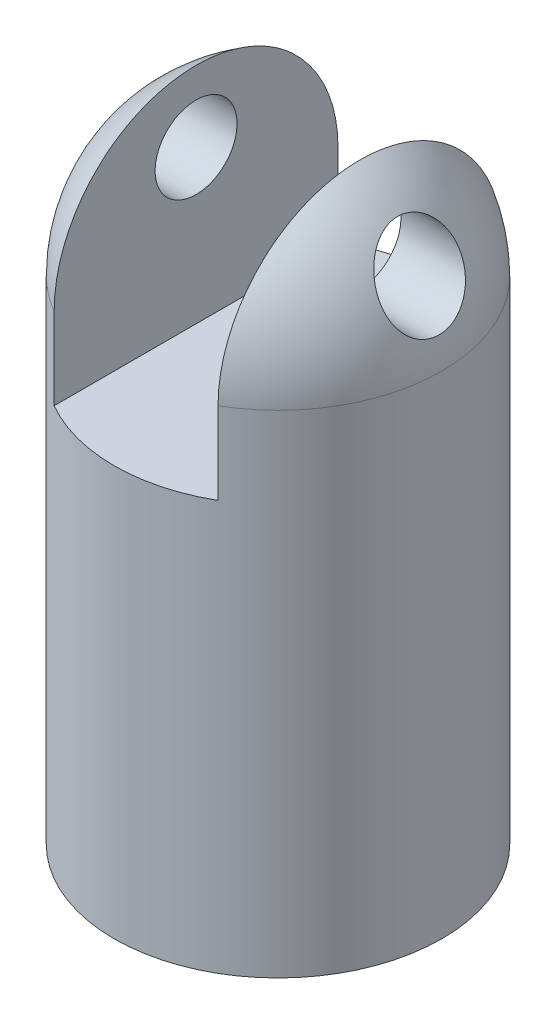
ISO-10303-21;
HEADER;
FILE_DESCRIPTION(('STEP AP214'),'2;1');
FILE_NAME('part.step','',(''),(''),'','','');
FILE_SCHEMA(('AUTOMOTIVE_DESIGN { 1 0 10303 214 1 1 1 1 }'));
ENDSEC;
DATA;
#1=APPLICATION_CONTEXT('core data for automotive mechanical design processes');
#2=APPLICATION_PROTOCOL_DEFINITION('international standard','automotive_design',2000,#1);
#3=PRODUCT_CONTEXT('',#1,'mechanical');
#4=PRODUCT('Part','Part','',(#3));
#5=PRODUCT_RELATED_PRODUCT_CATEGORY('part','',(#4));
#6=PRODUCT_DEFINITION_FORMATION('','',#4);
#7=PRODUCT_DEFINITION_CONTEXT('part definition',#1,'design');
#8=PRODUCT_DEFINITION('design','',#6,#7);
#9=PRODUCT_DEFINITION_SHAPE('','',#8);
#10=(LENGTH_UNIT() NAMED_UNIT(*) SI_UNIT(.MILLI.,.METRE.));
#11=(NAMED_UNIT(*) PLANE_ANGLE_UNIT() SI_UNIT($,.RADIAN.));
#12=(NAMED_UNIT(*) SI_UNIT($,.STERADIAN.) SOLID_ANGLE_UNIT());
#13=UNCERTAINTY_MEASURE_WITH_UNIT(LENGTH_MEASURE(1.E-05),#10,'distance_accuracy_value','');
#14=(GEOMETRIC_REPRESENTATION_CONTEXT(3) GLOBAL_UNCERTAINTY_ASSIGNED_CONTEXT((#13)) GLOBAL_UNIT_ASSIGNED_CONTEXT((#10,
#11,#12)) REPRESENTATION_CONTEXT('',''));
#15=CARTESIAN_POINT('',(0.,0.,0.));
#16=DIRECTION('',(0.,0.,1.));
#17=DIRECTION('',(1.,0.,0.));
#18=AXIS2_PLACEMENT_3D('',#15,#16,#17);
#19=CARTESIAN_POINT('',(0.,25.4,0.));
#20=DIRECTION('',(0.,-1.,0.));
#21=DIRECTION('',(1.,0.,0.));
#22=AXIS2_PLACEMENT_3D('',#19,#20,#21);
#23=SPHERICAL_SURFACE('',#22,25.4);
#24=CARTESIAN_POINT('',(24.1067659282736,31.9767327217544,-4.55744488247566));
#25=CARTESIAN_POINT('',(24.0444484163491,32.113320363722,-4.68996590607931));
#26=CARTESIAN_POINT('',(23.9794512611999,32.2552577564646,-4.81574696550168));
#27=CARTESIAN_POINT('',(23.8446059934324,32.5484309341725,-5.05320692182729));
#28=CARTESIAN_POINT('',(23.7747552980228,32.6996716648831,-5.16487821981101));
#29=CARTESIAN_POINT('',(23.6306199599598,33.0102944005367,-5.37377960125299));
#30=CARTESIAN_POINT('',(23.5563270822191,33.1696914418156,-5.47098161941725));
#31=CARTESIAN_POINT('',(23.4039229555365,33.4950510332104,-5.65038801800512));
#32=CARTESIAN_POINT('',(23.3258101389545,33.6610162733875,-5.73258617448005));
#33=CARTESIAN_POINT('',(23.1666752568291,33.9973570510674,-5.88137316864954));
#34=CARTESIAN_POINT('',(23.0856685104425,34.1677083247871,-5.94803322913717));
#35=CARTESIAN_POINT('',(22.9208956714156,34.5123306312923,-6.06613587048315));
#36=CARTESIAN_POINT('',(22.8371286071705,34.6866030372813,-6.11757302804721));
#37=CARTESIAN_POINT('',(22.5825557890585,35.2132197282875,-6.24885540931262));
#38=CARTESIAN_POINT('',(22.4082591017683,35.5698279594476,-6.30587461774937));
#39=CARTESIAN_POINT('',(22.0418942117782,36.3103676958626,-6.36101430271709));
#40=CARTESIAN_POINT('',(21.849446490856,36.6944294241809,-6.3546311154983));
#41=CARTESIAN_POINT('',(21.4631860729466,37.4549761078759,-6.27316051768274));
#42=CARTESIAN_POINT('',(21.2693727755179,37.8314574078448,-6.19804073542434));
#43=CARTESIAN_POINT('',(20.9776692437583,38.3904946137016,-6.03279535611646));
#44=CARTESIAN_POINT('',(20.8782044029929,38.5797392006624,-5.9669997748354));
#45=CARTESIAN_POINT('',(20.6811771080738,38.9519830545496,-5.81743206355566));
#46=CARTESIAN_POINT('',(20.5836139229022,39.1349847424543,-5.73366699607142));
#47=CARTESIAN_POINT('',(20.3911788847679,39.4934426715054,-5.54839762775656));
#48=CARTESIAN_POINT('',(20.2963088355268,39.6688938945172,-5.44688174965565));
#49=CARTESIAN_POINT('',(20.1103056355184,40.010564510069,-5.22656142828014));
#50=CARTESIAN_POINT('',(20.0191706359655,40.1767884847417,-5.10776567402362));
#51=CARTESIAN_POINT('',(19.8443211938262,40.4936329956252,-4.85717213462343));
#52=CARTESIAN_POINT('',(19.7604654443834,40.6445740987647,-4.72587880925253));
#53=CARTESIAN_POINT('',(19.598262484832,40.9347992223381,-4.44803604625286));
#54=CARTESIAN_POINT('',(19.5199124369688,41.0740892551315,-4.3014945659151));
#55=CARTESIAN_POINT('',(19.3698167544146,41.33945127325,-3.99386670936604));
#56=CARTESIAN_POINT('',(19.2980687089831,41.4655280857768,-3.83278568521531));
#57=CARTESIAN_POINT('',(19.1623390955179,41.7028426416225,-3.49698975300642));
#58=CARTESIAN_POINT('',(19.0983562498694,41.8140828263232,-3.32227709556493));
#59=CARTESIAN_POINT('',(18.9861531706613,42.0083110930847,-2.98107486577096));
#60=CARTESIAN_POINT('',(18.9369677778434,42.0930736062235,-2.81591158716087));
#61=CARTESIAN_POINT('',(18.8465064667782,42.2484556501779,-2.47699774258156));
#62=CARTESIAN_POINT('',(18.8052290769566,42.3190778124356,-2.30324878187852));
#63=CARTESIAN_POINT('',(18.7314104257847,42.4450450376803,-1.94869828909523));
#64=CARTESIAN_POINT('',(18.6988603744596,42.5004054735243,-1.76790406470532));
#65=CARTESIAN_POINT('',(18.6431369954342,42.5950013612391,-1.40073957041088));
#66=CARTESIAN_POINT('',(18.6199622147136,42.6342393118577,-1.21437016938364));
#67=CARTESIAN_POINT('',(18.5860482048552,42.691597640096,-0.864109321261313));
#68=CARTESIAN_POINT('',(18.5740281756377,42.7118952751756,-0.700694371574415));
#69=CARTESIAN_POINT('',(18.5575374687881,42.7397321379968,-0.372408807224453));
#70=CARTESIAN_POINT('',(18.5530660185726,42.7472726714048,-0.207538343267098));
#71=CARTESIAN_POINT('',(18.5517536983615,42.7494862796409,0.122261922017643));
#72=CARTESIAN_POINT('',(18.5549102947045,42.7441636269858,0.287191685454598));
#73=CARTESIAN_POINT('',(18.5687910579585,42.7207375024074,0.615818599191677));
#74=CARTESIAN_POINT('',(18.5795151071837,42.7026342292424,0.779515768620538));
#75=CARTESIAN_POINT('',(18.6073933269311,42.6555035701761,1.09373506656002));
#76=CARTESIAN_POINT('',(18.6240809769395,42.6272682590538,1.24441855532437));
#77=CARTESIAN_POINT('',(18.6636509661952,42.5601921686238,1.54262501781982));
#78=CARTESIAN_POINT('',(18.6865352716214,42.521348023133,1.690146972346));
#79=CARTESIAN_POINT('',(18.7381622665648,42.4335122518719,1.98102912935381));
#80=CARTESIAN_POINT('',(18.766903168393,42.3845237225369,2.12439058658194));
#81=CARTESIAN_POINT('',(18.8298762953943,42.2768916768668,2.40625187448572));
#82=CARTESIAN_POINT('',(18.864110614475,42.2182444787438,2.54474982672205));
#83=CARTESIAN_POINT('',(18.9392819419077,42.0890629012324,2.82217754682662));
#84=CARTESIAN_POINT('',(18.9804491751019,42.0181161385597,2.96085308967179));
#85=CARTESIAN_POINT('',(19.0678142264806,41.8670013211195,3.23145300978263));
#86=CARTESIAN_POINT('',(19.1140138568231,41.7868299439945,3.36337492977526));
#87=CARTESIAN_POINT('',(19.259398197427,41.53352779201,3.74811795215721));
#88=CARTESIAN_POINT('',(19.36541064445,41.3475367028026,3.99006972234366));
#89=CARTESIAN_POINT('',(19.6046478705394,40.9238424653064,4.46736717031787));
#90=CARTESIAN_POINT('',(19.739601683148,40.6826469641009,4.69871657879927));
#91=CARTESIAN_POINT('',(20.0222588163141,40.1717179345171,5.11808535579574));
#92=CARTESIAN_POINT('',(20.1699685208401,39.9019701010718,5.30608285311728));
#93=CARTESIAN_POINT('',(20.4932334202904,39.3046717841485,5.65789446865096));
#94=CARTESIAN_POINT('',(20.6699390802303,38.9741350198949,5.81557915711234));
#95=CARTESIAN_POINT('',(21.0290140158839,38.2934495378177,6.07156845306132));
#96=CARTESIAN_POINT('',(21.2113858300986,37.9432919715176,6.16984603010441));
#97=CARTESIAN_POINT('',(21.493333335013,37.3948629168557,6.27442986560052));
#98=CARTESIAN_POINT('',(21.592657419344,37.2003120816548,6.3022418752606));
#99=CARTESIAN_POINT('',(21.7909157660231,36.8092955224244,6.33973947957559));
#100=CARTESIAN_POINT('',(21.8898501402618,36.6128304143734,6.34943072336078));
#101=CARTESIAN_POINT('',(22.0867347992221,36.2192190219207,6.35052103788459));
#102=CARTESIAN_POINT('',(22.1846844572437,36.0220723992863,6.34190911937569));
#103=CARTESIAN_POINT('',(22.3788618015764,35.6286903773078,6.30625424483267));
#104=CARTESIAN_POINT('',(22.4750901745942,35.432454638798,6.27921881511904));
#105=CARTESIAN_POINT('',(22.666343975149,35.0399812292169,6.2062205702503));
#106=CARTESIAN_POINT('',(22.7613418671887,34.8437707818054,6.16003848238049));
#107=CARTESIAN_POINT('',(22.9482482983262,34.4553812049825,6.04875927522458));
#108=CARTESIAN_POINT('',(23.0401581673119,34.2632003539457,5.98367041790487));
#109=CARTESIAN_POINT('',(23.220280696089,33.8843976381466,5.83464757351826));
#110=CARTESIAN_POINT('',(23.3084921913687,33.6977775295746,5.75070770291203));
#111=CARTESIAN_POINT('',(23.4804498006942,33.3320137664689,5.56427271146433));
#112=CARTESIAN_POINT('',(23.5641982438117,33.1528662231498,5.46178739389397));
#113=CARTESIAN_POINT('',(23.7218507545008,32.8139342328101,5.24512160364916));
#114=CARTESIAN_POINT('',(23.7960440732733,32.6536294607785,5.13196556877372));
#115=CARTESIAN_POINT('',(23.9392472606288,32.3428672505327,4.89008224670179));
#116=CARTESIAN_POINT('',(24.0082597191461,32.1924048969562,4.76136282486635));
#117=CARTESIAN_POINT('',(24.1405177767839,31.9029086062082,4.4890352477524));
#118=CARTESIAN_POINT('',(24.2037648272001,31.7638717938185,4.3454308589476));
#119=CARTESIAN_POINT('',(24.3239066348453,31.498827084434,4.04421985781086));
#120=CARTESIAN_POINT('',(24.3808020615327,31.3728178144457,3.88661472430157));
#121=CARTESIAN_POINT('',(24.4825531701229,31.1467685039183,3.57423039759022));
#122=CARTESIAN_POINT('',(24.528039724328,31.0453976750076,3.4206181953348));
#123=CARTESIAN_POINT('',(24.6129279602025,30.8557590793566,3.10392115692758));
#124=CARTESIAN_POINT('',(24.6523303107103,30.7674898723921,2.94083736470696));
#125=CARTESIAN_POINT('',(24.7246570549309,30.6051373435997,2.60647481786112));
#126=CARTESIAN_POINT('',(24.7575845271505,30.5310472806917,2.43520000608039));
#127=CARTESIAN_POINT('',(24.8166488802023,30.3979354279071,2.08576132634077));
#128=CARTESIAN_POINT('',(24.8427862657652,30.3389125180426,1.90759797156283));
#129=CARTESIAN_POINT('',(24.8859955321855,30.2412252231228,1.56190415344241));
#130=CARTESIAN_POINT('',(24.9036643368117,30.2012228618724,1.39482500351083));
#131=CARTESIAN_POINT('',(24.9329678347654,30.1348327520086,1.05746721739549));
#132=CARTESIAN_POINT('',(24.9446029622739,30.1084440237645,0.887188812342826));
#133=CARTESIAN_POINT('',(24.9617277752377,30.0695916968093,0.544802229501386));
#134=CARTESIAN_POINT('',(24.9672195093803,30.0571234559231,0.372694681031411));
#135=CARTESIAN_POINT('',(24.9720121429463,30.0462429101723,0.0279500954681088));
#136=CARTESIAN_POINT('',(24.9713131725779,30.047830309678,-0.144686930412462));
#137=CARTESIAN_POINT('',(24.9639127542128,30.0646297726794,-0.480905671172986));
#138=CARTESIAN_POINT('',(24.9574989667483,30.0791888908572,-0.644526827779586));
#139=CARTESIAN_POINT('',(24.9391163415111,30.1208868004365,-0.969894983434491));
#140=CARTESIAN_POINT('',(24.9271457774274,30.1480295011472,-1.13164138403957));
#141=CARTESIAN_POINT('',(24.8977496917048,30.2146137242776,-1.4520857956883));
#142=CARTESIAN_POINT('',(24.8803238026496,30.2540560750788,-1.61078360064455));
#143=CARTESIAN_POINT('',(24.8401613361378,30.3448362887165,-1.92405246563178));
#144=CARTESIAN_POINT('',(24.8174245840659,30.3961745426767,-2.07862338978922));
#145=CARTESIAN_POINT('',(24.7666683845508,30.510585690838,-2.38356475890651));
#146=CARTESIAN_POINT('',(24.7386174876163,30.5737284138051,-2.53390374288728));
#147=CARTESIAN_POINT('',(24.6775528268641,30.7109095474267,-2.82841648982709));
#148=CARTESIAN_POINT('',(24.6445405240725,30.7849447503483,-2.97259205177888));
#149=CARTESIAN_POINT('',(24.5738272622961,30.9431655219281,-3.25385784727628));
#150=CARTESIAN_POINT('',(24.5361308889764,31.0273411607611,-3.39095482739646));
#151=CARTESIAN_POINT('',(24.4563008329916,31.2051405229397,-3.65744900085771));
#152=CARTESIAN_POINT('',(24.4141684970727,31.2987613783847,-3.78684851256489));
#153=CARTESIAN_POINT('',(24.3294353969177,31.4865094883919,-4.02689259779938));
#154=CARTESIAN_POINT('',(24.2871679571178,31.5799407352148,-4.13820082999341));
#155=CARTESIAN_POINT('',(24.1993647484731,31.77347586833,-4.35343492938125));
#156=CARTESIAN_POINT('',(24.1538295205679,31.8735786500422,-4.45736201278647));
#157=CARTESIAN_POINT('',(24.1067659282736,31.9767327217544,-4.55744488247566));
#158=B_SPLINE_CURVE_WITH_KNOTS('',3,(#24,#25,#26,#27,#28,#29,#30,#31,#32,#33,#34,#35,#36,#37,
#38,#39,#40,#41,#42,#43,#44,#45,#46,#47,#48,#49,#50,#51,#52,#53,#54,#55,#56,#57,#58,#59,#60,#61,
#62,#63,#64,#65,#66,#67,#68,#69,#70,#71,#72,#73,#74,#75,#76,#77,#78,#79,#80,#81,#82,#83,#84,#85,
#86,#87,#88,#89,#90,#91,#92,#93,#94,#95,#96,#97,#98,#99,#100,#101,#102,#103,#104,#105,#106,#107,
#108,#109,#110,#111,#112,#113,#114,#115,#116,#117,#118,#119,#120,#121,#122,#123,#124,#125,#126,
#127,#128,#129,#130,#131,#132,#133,#134,#135,#136,#137,#138,#139,#140,#141,#142,#143,#144,#145,
#146,#147,#148,#149,#150,#151,#152,#153,#154,#155,#156,#157),.UNSPECIFIED.,.T.,.F.,(4,2,2,2,2,2,
2,2,2,2,2,2,2,2,2,2,2,2,2,2,2,2,2,2,2,2,2,2,2,2,2,2,2,2,2,2,2,2,2,2,2,2,2,2,2,2,2,2,2,2,2,2,2,2,
2,2,2,2,2,2,2,2,2,2,2,2,4),(0.,0.600609055431747,1.20154020707553,1.80362217600176,
2.40595333764768,3.00546674548304,3.60519347889519,4.80300834444186,6.08648319252329,
7.37056280739217,8.04094750271181,8.71106919910657,9.38162959751539,10.0518539693433,
10.7017230174655,11.3512546145263,12.0005480841184,12.6497345796639,13.2250544577627,
13.8002671722537,14.3748983507144,14.9494404361756,15.4441194127268,15.9387477567118,
16.4332118321053,16.9276682179845,17.3897794482795,17.8520374771656,18.314154615513,
18.7764483177551,19.259282203551,19.7422905354347,20.7077883297556,21.7848871163496,
22.8625281200307,24.0774176030192,25.292859449721,25.9528260630358,26.6125868981067,
27.2727439665241,27.932631510993,28.6002946874182,29.2676665431305,29.935246980678,
30.6024755552922,31.2309664558278,31.8591410494711,32.4871570768408,33.1151068489794,
33.6830996200317,34.251029906936,34.8186895127351,35.3863069103475,35.9037743399675,
36.4212045276724,36.9384621122458,37.4557088174535,37.9483039917629,38.4410523019996,
38.9338338060074,39.4266315144097,39.9224422878582,40.4181073408757,40.9132909097269,
41.408324573349,41.8619930217139,42.3155865436649),.UNSPECIFIED.);
#159=CARTESIAN_POINT('',(24.1067659282736,31.9767327217544,-4.55744488247566));
#160=VERTEX_POINT('',#159);
#161=EDGE_CURVE('E88',#160,#160,#158,.T.);
#162=ORIENTED_EDGE('',*,*,#161,.F.);
#163=EDGE_LOOP('',(#162));
#164=FACE_BOUND('',#163,.T.);
#165=CARTESIAN_POINT('',(12.7,25.4,0.));
#166=DIRECTION('',(1.,0.,0.));
#167=DIRECTION('',(0.,1.,0.));
#168=AXIS2_PLACEMENT_3D('',#165,#166,#167);
#169=CIRCLE('',#168,21.9970452561247);
#170=CARTESIAN_POINT('',(12.7,25.4,21.9970452561247));
#171=VERTEX_POINT('',#170);
#172=CARTESIAN_POINT('',(12.7,25.4,-21.9970452561247));
#173=VERTEX_POINT('',#172);
#174=EDGE_CURVE('E105',#171,#173,#169,.F.);
#175=ORIENTED_EDGE('',*,*,#174,.F.);
#176=CARTESIAN_POINT('',(0.,25.4,0.));
#177=DIRECTION('',(0.,-1.,0.));
#178=DIRECTION('',(0.,0.,-1.));
#179=AXIS2_PLACEMENT_3D('',#176,#177,#178);
#180=CIRCLE('',#179,25.4);
#181=EDGE_CURVE('E99',#173,#171,#180,.T.);
#182=ORIENTED_EDGE('',*,*,#181,.F.);
#183=EDGE_LOOP('',(#175,#182));
#184=FACE_BOUND('',#183,.T.);
#185=ADVANCED_FACE('F32',(#164,#184),#23,.T.);
#186=CARTESIAN_POINT('',(25.4,-50.8,0.));
#187=DIRECTION('',(0.,-1.,0.));
#188=DIRECTION('',(0.,0.,-1.));
#189=AXIS2_PLACEMENT_3D('',#186,#187,#188);
#190=PLANE('',#189);
#191=CARTESIAN_POINT('',(0.,-50.8,0.));
#192=DIRECTION('',(0.,-1.,0.));
#193=DIRECTION('',(0.,0.,-1.));
#194=AXIS2_PLACEMENT_3D('',#191,#192,#193);
#195=CIRCLE('',#194,6.35);
#196=CARTESIAN_POINT('',(0.,-50.8,-6.35));
#197=VERTEX_POINT('',#196);
#198=EDGE_CURVE('E162',#197,#197,#195,.T.);
#199=ORIENTED_EDGE('',*,*,#198,.F.);
#200=EDGE_LOOP('',(#199));
#201=FACE_BOUND('',#200,.T.);
#202=CARTESIAN_POINT('',(0.,-50.8,0.));
#203=DIRECTION('',(0.,-1.,0.));
#204=DIRECTION('',(0.,0.,-1.));
#205=AXIS2_PLACEMENT_3D('',#202,#203,#204);
#206=CIRCLE('',#205,25.4);
#207=CARTESIAN_POINT('',(0.,-50.8,-25.4));
#208=VERTEX_POINT('',#207);
#209=EDGE_CURVE('E102',#208,#208,#206,.T.);
#210=ORIENTED_EDGE('',*,*,#209,.T.);
#211=EDGE_LOOP('',(#210));
#212=FACE_BOUND('',#211,.T.);
#213=ADVANCED_FACE('F34',(#201,#212),#190,.T.);
#214=CARTESIAN_POINT('',(-24.1067659282737,31.9767327217544,-4.55744488247567));
#215=CARTESIAN_POINT('',(-24.1615603172108,31.8566349990557,-4.44092715153506));
#216=CARTESIAN_POINT('',(-24.2142715131661,31.7406957878061,-4.31921536996981));
#217=CARTESIAN_POINT('',(-24.3151994023185,31.5180332430236,-4.06592169547366));
#218=CARTESIAN_POINT('',(-24.36341740763,31.4113072197038,-3.93434270437792));
#219=CARTESIAN_POINT('',(-24.4550511983215,31.2079420682348,-3.66187143542214));
#220=CARTESIAN_POINT('',(-24.4984634160644,31.1113104367443,-3.52097236100299));
#221=CARTESIAN_POINT('',(-24.5800953970052,30.9291779806055,-3.23080407064966));
#222=CARTESIAN_POINT('',(-24.6183173177503,30.8436725315511,-3.08153836930633));
#223=CARTESIAN_POINT('',(-24.6893917457881,30.6843552882006,-2.77501747246245));
#224=CARTESIAN_POINT('',(-24.7222264243764,30.6105823455966,-2.61773791972531));
#225=CARTESIAN_POINT('',(-24.7820782938099,30.4758858846986,-2.2967697593963));
#226=CARTESIAN_POINT('',(-24.8090977539316,30.4149573543124,-2.13308368140475));
#227=CARTESIAN_POINT('',(-24.8570885207483,30.3066011060729,-1.80044128304886));
#228=CARTESIAN_POINT('',(-24.878060015517,30.2591729683982,-1.63148512674933));
#229=CARTESIAN_POINT('',(-24.9137566155171,30.1783713391986,-1.28959965525727));
#230=CARTESIAN_POINT('',(-24.9284820061802,30.1449972054403,-1.11667052200092));
#231=CARTESIAN_POINT('',(-24.9509933812063,30.0939508575587,-0.776545073006986));
#232=CARTESIAN_POINT('',(-24.9590771061153,30.0756050652805,-0.609469224010855));
#233=CARTESIAN_POINT('',(-24.9693793843397,30.0522211885107,-0.274210509299681));
#234=CARTESIAN_POINT('',(-24.9715981149781,30.047182701684,-0.106027677207471));
#235=CARTESIAN_POINT('',(-24.9701505755965,30.0504691639374,0.230154683168544));
#236=CARTESIAN_POINT('',(-24.9664852218271,30.0587920324303,0.398154235915799));
#237=CARTESIAN_POINT('',(-24.953304463044,30.0887042570049,0.732735210201848));
#238=CARTESIAN_POINT('',(-24.9437891088714,30.1102934977914,0.899316644052469));
#239=CARTESIAN_POINT('',(-24.9193258892848,30.1657465332992,1.225406420504));
#240=CARTESIAN_POINT('',(-24.9045300534054,30.1992667589546,1.38498479945651));
#241=CARTESIAN_POINT('',(-24.8695957855658,30.2783147528563,1.70059667821662));
#242=CARTESIAN_POINT('',(-24.8494555799468,30.3238465073909,1.85662898247527));
#243=CARTESIAN_POINT('',(-24.8040057676937,30.4264393401338,2.16401620875617));
#244=CARTESIAN_POINT('',(-24.7786979455378,30.4834964383447,2.31537272470239));
#245=CARTESIAN_POINT('',(-24.7230958487316,30.6086224776484,2.61257810468568));
#246=CARTESIAN_POINT('',(-24.6927996969228,30.6766955640024,2.75842486984904));
#247=CARTESIAN_POINT('',(-24.6266639718543,30.8249804689179,3.04714565238958));
#248=CARTESIAN_POINT('',(-24.5907081962957,30.9054457319161,3.18986282153546));
#249=CARTESIAN_POINT('',(-24.5140648823414,31.0765392840549,3.46779983190332));
#250=CARTESIAN_POINT('',(-24.4733756318834,31.1671712499893,3.60301693413001));
#251=CARTESIAN_POINT('',(-24.3875700458774,31.3577668406224,3.86516988613331));
#252=CARTESIAN_POINT('',(-24.3424545505444,31.4577286940942,3.99210730002024));
#253=CARTESIAN_POINT('',(-24.2480736028722,31.6662122593763,4.23717293325775));
#254=CARTESIAN_POINT('',(-24.1988065884961,31.774737192117,4.35529780502911));
#255=CARTESIAN_POINT('',(-24.0930854398396,32.0068512103796,4.5896250891947));
#256=CARTESIAN_POINT('',(-24.0363719392852,32.1309613730268,4.7051953225631));
#257=CARTESIAN_POINT('',(-23.9189651944343,32.3869183097408,4.9252469017686));
#258=CARTESIAN_POINT('',(-23.8582704864151,32.5187679273862,5.02972413178521));
#259=CARTESIAN_POINT('',(-23.670785876963,32.924395482599,5.32586649581176));
#260=CARTESIAN_POINT('',(-23.5385277169801,33.2084013776446,5.50039159488251));
#261=CARTESIAN_POINT('',(-23.2503809154725,33.8214642232553,5.81466536314119));
#262=CARTESIAN_POINT('',(-23.0934368559411,34.1522838020697,5.94996958296969));
#263=CARTESIAN_POINT('',(-22.7696200259886,34.827430885867,6.162750481188));
#264=CARTESIAN_POINT('',(-22.6027433733441,35.1717636544229,6.24020438598697));
#265=CARTESIAN_POINT('',(-22.2479816501414,35.89533736496,6.34145748107917));
#266=CARTESIAN_POINT('',(-22.0595265870522,36.2750258060695,6.36004779797922));
#267=CARTESIAN_POINT('',(-21.6795922212548,37.0304851454668,6.32976948138732));
#268=CARTESIAN_POINT('',(-21.4881118538413,37.4062545836475,6.28087655086021));
#269=CARTESIAN_POINT('',(-21.1974404196384,37.9691275064737,6.15592150616813));
#270=CARTESIAN_POINT('',(-21.097441056827,38.1613903946098,6.10365317494819));
#271=CARTESIAN_POINT('',(-20.8987430716516,38.5407365820196,5.98106183155738));
#272=CARTESIAN_POINT('',(-20.8000439920969,38.7278217287585,5.91074535359119));
#273=CARTESIAN_POINT('',(-20.6046755243435,39.095562274711,5.75226964433556));
#274=CARTESIAN_POINT('',(-20.5080075950865,39.2762131129321,5.6640980411218));
#275=CARTESIAN_POINT('',(-20.3176818120112,39.6294499441862,5.47029860065325));
#276=CARTESIAN_POINT('',(-20.2240225751325,39.802039659878,5.364678925303));
#277=CARTESIAN_POINT('',(-20.0419723896207,40.1352748373215,5.13801425499881));
#278=CARTESIAN_POINT('',(-19.9535242340947,40.2960585898308,5.01721884945359));
#279=CARTESIAN_POINT('',(-19.7814726555333,40.6068485680474,4.75953944988538));
#280=CARTESIAN_POINT('',(-19.6978668918315,40.7568600093188,4.62266332734692));
#281=CARTESIAN_POINT('',(-19.5365589572685,41.0445725112122,4.33339663238924));
#282=CARTESIAN_POINT('',(-19.4588558146999,41.1822755987348,4.18100862329115));
#283=CARTESIAN_POINT('',(-19.3105245942678,41.4437066276086,3.86150330022097));
#284=CARTESIAN_POINT('',(-19.2398954961992,41.5674365844669,3.69438811672719));
#285=CARTESIAN_POINT('',(-19.1136294427977,41.7875532232373,3.36395766996697));
#286=CARTESIAN_POINT('',(-19.0571993004111,41.8854377324358,3.20194283760412));
#287=CARTESIAN_POINT('',(-18.9520092941505,42.0671981113691,2.86788406647819));
#288=CARTESIAN_POINT('',(-18.903247988885,42.1510766137776,2.6958420207254));
#289=CARTESIAN_POINT('',(-18.814347426968,42.3035115093611,2.34317517957212));
#290=CARTESIAN_POINT('',(-18.7741991046578,42.3720840160823,2.16255965531667));
#291=CARTESIAN_POINT('',(-18.7033056990095,42.4928691686845,1.79415593120481));
#292=CARTESIAN_POINT('',(-18.6725589756152,42.5450846679927,1.60636898879877));
#293=CARTESIAN_POINT('',(-18.6248181331507,42.6260242021947,1.25253183152654));
#294=CARTESIAN_POINT('',(-18.6064914517503,42.6570305813853,1.08717945870013));
#295=CARTESIAN_POINT('',(-18.5776044570324,42.7058617016849,0.753876895159823));
#296=CARTESIAN_POINT('',(-18.5670431621065,42.7236881088518,0.585927035530924));
#297=CARTESIAN_POINT('',(-18.5538876629006,42.7458885757763,0.248906598657259));
#298=CARTESIAN_POINT('',(-18.5512898843257,42.750268670694,0.079836558345812));
#299=CARTESIAN_POINT('',(-18.5541013726952,42.7455261940066,-0.258045365742084));
#300=CARTESIAN_POINT('',(-18.5595103343294,42.7364041372609,-0.426857259116396));
#301=CARTESIAN_POINT('',(-18.5774344840711,42.7061424613483,-0.748514653943864));
#302=CARTESIAN_POINT('',(-18.5893079165007,42.6860879539272,-0.901499775059955));
#303=CARTESIAN_POINT('',(-18.6194898263638,42.6350341525368,-1.20503744230425));
#304=CARTESIAN_POINT('',(-18.6378003211078,42.6040314274925,-1.35558921035533));
#305=CARTESIAN_POINT('',(-18.6805738927541,42.5314651914106,-1.65316767085902));
#306=CARTESIAN_POINT('',(-18.7050347503418,42.4899054897272,-1.80019561394217));
#307=CARTESIAN_POINT('',(-18.7597761946808,42.3966712162958,-2.08994954126388));
#308=CARTESIAN_POINT('',(-18.7900590041143,42.3449927813177,-2.23267385832889));
#309=CARTESIAN_POINT('',(-18.8568882394324,42.2306199556022,-2.51657478346615));
#310=CARTESIAN_POINT('',(-18.8935749914693,42.1676777374403,-2.65761856531444));
#311=CARTESIAN_POINT('',(-18.9721857960725,42.0323571962651,-2.93360906678705));
#312=CARTESIAN_POINT('',(-19.0141117182969,41.9599755042632,-3.06855358629258));
#313=CARTESIAN_POINT('',(-19.1470228134753,41.7296633737627,-3.46324980386748));
#314=CARTESIAN_POINT('',(-19.245182105283,41.5584964597747,-3.71303430790493));
#315=CARTESIAN_POINT('',(-19.467958238693,41.1665386822022,-4.20694447612861));
#316=CARTESIAN_POINT('',(-19.5942811131148,40.9424003637349,-4.44761672857736));
#317=CARTESIAN_POINT('',(-19.8607602042861,40.4644311214761,-4.88841996450517));
#318=CARTESIAN_POINT('',(-20.0009233031319,40.2105854138538,-5.08853062609014));
#319=CARTESIAN_POINT('',(-20.3096745282074,39.6450452984716,-5.46931480158647));
#320=CARTESIAN_POINT('',(-20.4795918517823,39.3301178197129,-5.64410380541294));
#321=CARTESIAN_POINT('',(-20.8266016969798,38.6784995322855,-5.93732599649962));
#322=CARTESIAN_POINT('',(-21.0036973222915,38.3417992714199,-6.05573451825244));
#323=CARTESIAN_POINT('',(-21.27973670744,37.8101866969173,-6.19416063808391));
#324=CARTESIAN_POINT('',(-21.3778659089828,37.619891817615,-6.2344640215001));
#325=CARTESIAN_POINT('',(-21.574222285387,37.2364781956251,-6.29746246907523));
#326=CARTESIAN_POINT('',(-21.6724494234832,37.0433602897598,-6.32016264763277));
#327=CARTESIAN_POINT('',(-21.8684387905401,36.6554209313342,-6.34778400126947));
#328=CARTESIAN_POINT('',(-21.9662005379498,36.4605981369911,-6.35268961492517));
#329=CARTESIAN_POINT('',(-22.1605086515237,36.0708099903178,-6.34453200731704));
#330=CARTESIAN_POINT('',(-22.2570554709789,35.8758447217143,-6.33147570112176));
#331=CARTESIAN_POINT('',(-22.4509059119418,35.4818753031888,-6.28670047823195));
#332=CARTESIAN_POINT('',(-22.5481608285552,35.2829024259896,-6.25449223361783));
#333=CARTESIAN_POINT('',(-22.7400579915497,34.8878181908935,-6.17098236073776));
#334=CARTESIAN_POINT('',(-22.83470127718,34.6917057098405,-6.11968844846746));
#335=CARTESIAN_POINT('',(-23.0206525885909,34.3040681437238,-5.99808097406544));
#336=CARTESIAN_POINT('',(-23.1119636752579,34.1125389072752,-5.92778539245719));
#337=CARTESIAN_POINT('',(-23.2906150406269,33.7356755184607,-5.76832821023971));
#338=CARTESIAN_POINT('',(-23.3779565214379,33.5503394951767,-5.67917236792384));
#339=CARTESIAN_POINT('',(-23.5803847178913,33.1185015634629,-5.44473218990545));
#340=CARTESIAN_POINT('',(-23.6933891902496,32.8755466212667,-5.29099714829377));
#341=CARTESIAN_POINT('',(-23.9086417221835,32.409731871794,-4.94928410423293));
#342=CARTESIAN_POINT('',(-24.010892593771,32.1868668133036,-4.76131508909071));
#343=CARTESIAN_POINT('',(-24.1067659282737,31.9767327217544,-4.55744488247567));
#344=B_SPLINE_CURVE_WITH_KNOTS('',3,(#214,#215,#216,#217,#218,#219,#220,#221,#222,#223,#224,
#225,#226,#227,#228,#229,#230,#231,#232,#233,#234,#235,#236,#237,#238,#239,#240,#241,#242,#243,
#244,#245,#246,#247,#248,#249,#250,#251,#252,#253,#254,#255,#256,#257,#258,#259,#260,#261,#262,
#263,#264,#265,#266,#267,#268,#269,#270,#271,#272,#273,#274,#275,#276,#277,#278,#279,#280,#281,
#282,#283,#284,#285,#286,#287,#288,#289,#290,#291,#292,#293,#294,#295,#296,#297,#298,#299,#300,
#301,#302,#303,#304,#305,#306,#307,#308,#309,#310,#311,#312,#313,#314,#315,#316,#317,#318,#319,
#320,#321,#322,#323,#324,#325,#326,#327,#328,#329,#330,#331,#332,#333,#334,#335,#336,#337,#338,
#339,#340,#341,#342,#343),.UNSPECIFIED.,.T.,.F.,(4,2,2,2,2,2,2,2,2,2,2,2,2,2,2,2,2,2,2,2,2,2,2,
2,2,2,2,2,2,2,2,2,2,2,2,2,2,2,2,2,2,2,2,2,2,2,2,2,2,2,2,2,2,2,2,2,2,2,2,2,2,2,2,2,4),(0.,
0.527997158739538,1.05583964385844,1.58407138831245,2.11208287624564,2.64180799457236,
3.17132602161369,3.70082758044791,4.23030493973973,4.73450370652237,5.23868722910402,
5.74279224946982,6.24689288882332,6.7375172333384,7.22830460754276,7.7189227891058,
8.20972601896873,8.71238191445538,9.21522018538732,9.71796318871129,10.2208962044095,
10.7567560856855,11.2928140965553,12.3642721950621,13.5305512532108,14.6972891918907,
15.9647447949203,17.2326568586138,17.9007775705215,18.5686567343776,19.2370002690413,
19.9050320449482,20.5632432542777,21.2211336023001,21.8789154106583,22.5366022179949,
23.1283148717256,23.7199161772136,24.3108916995641,24.9017640706577,25.4087714525772,
25.9157147335907,26.422430448004,26.9291268410066,27.3928394906077,27.8566975928242,
28.3203885547679,28.7842568956457,29.259982919994,29.7358792000542,30.6871130355996,
31.7399377685436,32.7932886838733,33.9832183486697,35.1736681103578,35.8266475112243,
36.4794371256576,37.1327974699724,37.7859063507744,38.4564657419732,39.1267543319823,
39.79641086157,40.4658632302631,41.3899381740532,42.3137708729517),.UNSPECIFIED.);
#345=CARTESIAN_POINT('',(-24.1067659282737,31.9767327217544,-4.55744488247567));
#346=VERTEX_POINT('',#345);
#347=EDGE_CURVE('E114',#346,#346,#344,.T.);
#348=ORIENTED_EDGE('',*,*,#347,.F.);
#349=EDGE_LOOP('',(#348));
#350=FACE_BOUND('',#349,.T.);
#351=CARTESIAN_POINT('',(-12.7,25.4,0.));
#352=DIRECTION('',(-1.,0.,0.));
#353=DIRECTION('',(0.,-1.,0.));
#354=AXIS2_PLACEMENT_3D('',#351,#352,#353);
#355=CIRCLE('',#354,21.9970452561248);
#356=CARTESIAN_POINT('',(-12.7,25.4,-21.9970452561247));
#357=VERTEX_POINT('',#356);
#358=CARTESIAN_POINT('',(-12.7,25.4,21.9970452561247));
#359=VERTEX_POINT('',#358);
#360=EDGE_CURVE('E48',#357,#359,#355,.F.);
#361=ORIENTED_EDGE('',*,*,#360,.F.);
#362=EDGE_CURVE('E94',#359,#357,#180,.T.);
#363=ORIENTED_EDGE('',*,*,#362,.F.);
#364=EDGE_LOOP('',(#361,#363));
#365=FACE_BOUND('',#364,.T.);
#366=ADVANCED_FACE('F118',(#350,#365),#23,.T.);
#367=CARTESIAN_POINT('',(0.,-50.8,0.));
#368=DIRECTION('',(0.,-1.,0.));
#369=DIRECTION('',(0.,0.,-1.));
#370=AXIS2_PLACEMENT_3D('',#367,#368,#369);
#371=CYLINDRICAL_SURFACE('',#370,25.4);
#372=DIRECTION('',(0.,-1.,0.));
#373=VECTOR('',#372,1.);
#374=CARTESIAN_POINT('',(12.7,-50.8,-21.9970452561247));
#375=LINE('',#374,#373);
#376=CARTESIAN_POINT('',(12.7,12.7,-21.9970452561247));
#377=VERTEX_POINT('',#376);
#378=EDGE_CURVE('E11',#173,#377,#375,.T.);
#379=ORIENTED_EDGE('',*,*,#378,.F.);
#380=ORIENTED_EDGE('',*,*,#181,.T.);
#381=DIRECTION('',(0.,-1.,0.));
#382=VECTOR('',#381,1.);
#383=CARTESIAN_POINT('',(12.7,-50.8,21.9970452561247));
#384=LINE('',#383,#382);
#385=CARTESIAN_POINT('',(12.7,12.7,21.9970452561247));
#386=VERTEX_POINT('',#385);
#387=EDGE_CURVE('E56',#386,#171,#384,.F.);
#388=ORIENTED_EDGE('',*,*,#387,.F.);
#389=CARTESIAN_POINT('',(0.,12.7,0.));
#390=DIRECTION('',(0.,-1.,0.));
#391=DIRECTION('',(0.,0.,-1.));
#392=AXIS2_PLACEMENT_3D('',#389,#390,#391);
#393=CIRCLE('',#392,25.4);
#394=CARTESIAN_POINT('',(-12.7,12.7,21.9970452561247));
#395=VERTEX_POINT('',#394);
#396=EDGE_CURVE('E85',#395,#386,#393,.F.);
#397=ORIENTED_EDGE('',*,*,#396,.F.);
#398=DIRECTION('',(0.,-1.,0.));
#399=VECTOR('',#398,1.);
#400=CARTESIAN_POINT('',(-12.7,-50.8,21.9970452561247));
#401=LINE('',#400,#399);
#402=EDGE_CURVE('E87',#359,#395,#401,.T.);
#403=ORIENTED_EDGE('',*,*,#402,.F.);
#404=ORIENTED_EDGE('',*,*,#362,.T.);
#405=DIRECTION('',(0.,-1.,0.));
#406=VECTOR('',#405,1.);
#407=CARTESIAN_POINT('',(-12.7,-50.8,-21.9970452561247));
#408=LINE('',#407,#406);
#409=CARTESIAN_POINT('',(-12.7,12.7,-21.9970452561247));
#410=VERTEX_POINT('',#409);
#411=EDGE_CURVE('E83',#410,#357,#408,.F.);
#412=ORIENTED_EDGE('',*,*,#411,.F.);
#413=EDGE_CURVE('E41',#377,#410,#393,.F.);
#414=ORIENTED_EDGE('',*,*,#413,.F.);
#415=EDGE_LOOP('',(#379,#380,#388,#397,#403,#404,#412,#414));
#416=FACE_BOUND('',#415,.T.);
#417=ORIENTED_EDGE('',*,*,#209,.F.);
#418=EDGE_LOOP('',(#417));
#419=FACE_BOUND('',#418,.T.);
#420=ADVANCED_FACE('F91',(#416,#419),#371,.T.);
#421=CARTESIAN_POINT('',(12.7,50.8,-101.6));
#422=DIRECTION('',(1.,0.,0.));
#423=DIRECTION('',(0.,1.,0.));
#424=AXIS2_PLACEMENT_3D('',#421,#422,#423);
#425=PLANE('',#424);
#426=CARTESIAN_POINT('',(12.7,36.3985226280624,0.));
#427=DIRECTION('',(1.,0.,0.));
#428=DIRECTION('',(0.,1.,0.));
#429=AXIS2_PLACEMENT_3D('',#426,#427,#428);
#430=CIRCLE('',#429,6.35);
#431=CARTESIAN_POINT('',(12.7,42.7485226280624,0.));
#432=VERTEX_POINT('',#431);
#433=EDGE_CURVE('E157',#432,#432,#430,.T.);
#434=ORIENTED_EDGE('',*,*,#433,.T.);
#435=EDGE_LOOP('',(#434));
#436=FACE_BOUND('',#435,.T.);
#437=ORIENTED_EDGE('',*,*,#387,.T.);
#438=ORIENTED_EDGE('',*,*,#174,.T.);
#439=ORIENTED_EDGE('',*,*,#378,.T.);
#440=DIRECTION('',(0.,0.,1.));
#441=VECTOR('',#440,1.);
#442=CARTESIAN_POINT('',(12.7,12.7,-101.6));
#443=LINE('',#442,#441);
#444=EDGE_CURVE('E79',#377,#386,#443,.T.);
#445=ORIENTED_EDGE('',*,*,#444,.T.);
#446=EDGE_LOOP('',(#437,#438,#439,#445));
#447=FACE_BOUND('',#446,.T.);
#448=ADVANCED_FACE('F133',(#436,#447),#425,.F.);
#449=CARTESIAN_POINT('',(-12.7,12.7,-101.6));
#450=DIRECTION('',(0.,-1.,0.));
#451=DIRECTION('',(0.,0.,-1.));
#452=AXIS2_PLACEMENT_3D('',#449,#450,#451);
#453=PLANE('',#452);
#454=ORIENTED_EDGE('',*,*,#396,.T.);
#455=ORIENTED_EDGE('',*,*,#444,.F.);
#456=ORIENTED_EDGE('',*,*,#413,.T.);
#457=DIRECTION('',(0.,0.,1.));
#458=VECTOR('',#457,1.);
#459=CARTESIAN_POINT('',(-12.7,12.7,-101.6));
#460=LINE('',#459,#458);
#461=EDGE_CURVE('E77',#410,#395,#460,.T.);
#462=ORIENTED_EDGE('',*,*,#461,.T.);
#463=EDGE_LOOP('',(#454,#455,#456,#462));
#464=FACE_BOUND('',#463,.T.);
#465=ADVANCED_FACE('F76',(#464),#453,.F.);
#466=CARTESIAN_POINT('',(-12.7,50.8,-101.6));
#467=DIRECTION('',(-1.,0.,0.));
#468=DIRECTION('',(0.,-1.,0.));
#469=AXIS2_PLACEMENT_3D('',#466,#467,#468);
#470=PLANE('',#469);
#471=CARTESIAN_POINT('',(-12.7,36.3985226280624,0.));
#472=DIRECTION('',(-1.,0.,0.));
#473=DIRECTION('',(0.,-1.,0.));
#474=AXIS2_PLACEMENT_3D('',#471,#472,#473);
#475=CIRCLE('',#474,6.35);
#476=CARTESIAN_POINT('',(-12.7,30.0485226280624,0.));
#477=VERTEX_POINT('',#476);
#478=EDGE_CURVE('E36',#477,#477,#475,.T.);
#479=ORIENTED_EDGE('',*,*,#478,.T.);
#480=EDGE_LOOP('',(#479));
#481=FACE_BOUND('',#480,.T.);
#482=ORIENTED_EDGE('',*,*,#411,.T.);
#483=ORIENTED_EDGE('',*,*,#360,.T.);
#484=ORIENTED_EDGE('',*,*,#402,.T.);
#485=ORIENTED_EDGE('',*,*,#461,.F.);
#486=EDGE_LOOP('',(#482,#483,#484,#485));
#487=FACE_BOUND('',#486,.T.);
#488=ADVANCED_FACE('F86',(#481,#487),#470,.F.);
#489=CARTESIAN_POINT('',(-114.3,36.3985226280623,0.));
#490=DIRECTION('',(1.,0.,0.));
#491=DIRECTION('',(0.,1.,0.));
#492=AXIS2_PLACEMENT_3D('',#489,#490,#491);
#493=CYLINDRICAL_SURFACE('',#492,6.35);
#494=ORIENTED_EDGE('',*,*,#347,.T.);
#495=EDGE_LOOP('',(#494));
#496=FACE_BOUND('',#495,.T.);
#497=ORIENTED_EDGE('',*,*,#478,.F.);
#498=EDGE_LOOP('',(#497));
#499=FACE_BOUND('',#498,.T.);
#500=ADVANCED_FACE('F127',(#496,#499),#493,.F.);
#501=ORIENTED_EDGE('',*,*,#161,.T.);
#502=EDGE_LOOP('',(#501));
#503=FACE_BOUND('',#502,.T.);
#504=ORIENTED_EDGE('',*,*,#433,.F.);
#505=EDGE_LOOP('',(#504));
#506=FACE_BOUND('',#505,.T.);
#507=ADVANCED_FACE('F121',(#503,#506),#493,.F.);
#508=CARTESIAN_POINT('',(0.,-25.4,0.));
#509=DIRECTION('',(0.,-1.,0.));
#510=DIRECTION('',(0.,0.,-1.));
#511=AXIS2_PLACEMENT_3D('',#508,#509,#510);
#512=CYLINDRICAL_SURFACE('',#511,6.35);
#513=CARTESIAN_POINT('',(0.,-25.4,0.));
#514=DIRECTION('',(0.,-1.,0.));
#515=DIRECTION('',(0.,0.,-1.));
#516=AXIS2_PLACEMENT_3D('',#513,#514,#515);
#517=CIRCLE('',#516,6.35);
#518=CARTESIAN_POINT('',(0.,-25.4,-6.35));
#519=VERTEX_POINT('',#518);
#520=EDGE_CURVE('E160',#519,#519,#517,.T.);
#521=ORIENTED_EDGE('',*,*,#520,.F.);
#522=EDGE_LOOP('',(#521));
#523=FACE_BOUND('',#522,.T.);
#524=ORIENTED_EDGE('',*,*,#198,.T.);
#525=EDGE_LOOP('',(#524));
#526=FACE_BOUND('',#525,.T.);
#527=ADVANCED_FACE('F126',(#523,#526),#512,.F.);
#528=CARTESIAN_POINT('',(0.,-25.4,0.));
#529=DIRECTION('',(0.,-1.,0.));
#530=DIRECTION('',(0.,0.,-1.));
#531=AXIS2_PLACEMENT_3D('',#528,#529,#530);
#532=PLANE('',#531);
#533=ORIENTED_EDGE('',*,*,#520,.T.);
#534=EDGE_LOOP('',(#533));
#535=FACE_BOUND('',#534,.T.);
#536=ADVANCED_FACE('F168',(#535),#532,.T.);
#537=CLOSED_SHELL('',(#185,#213,#366,#420,#448,#465,#488,#500,#507,#527,#536));
#538=MANIFOLD_SOLID_BREP('B2',#537);
#539=ADVANCED_BREP_SHAPE_REPRESENTATION('',(#18,#538),#14);
#540=SHAPE_DEFINITION_REPRESENTATION(#9,#539);
ENDSEC;
END-ISO-10303-21;
